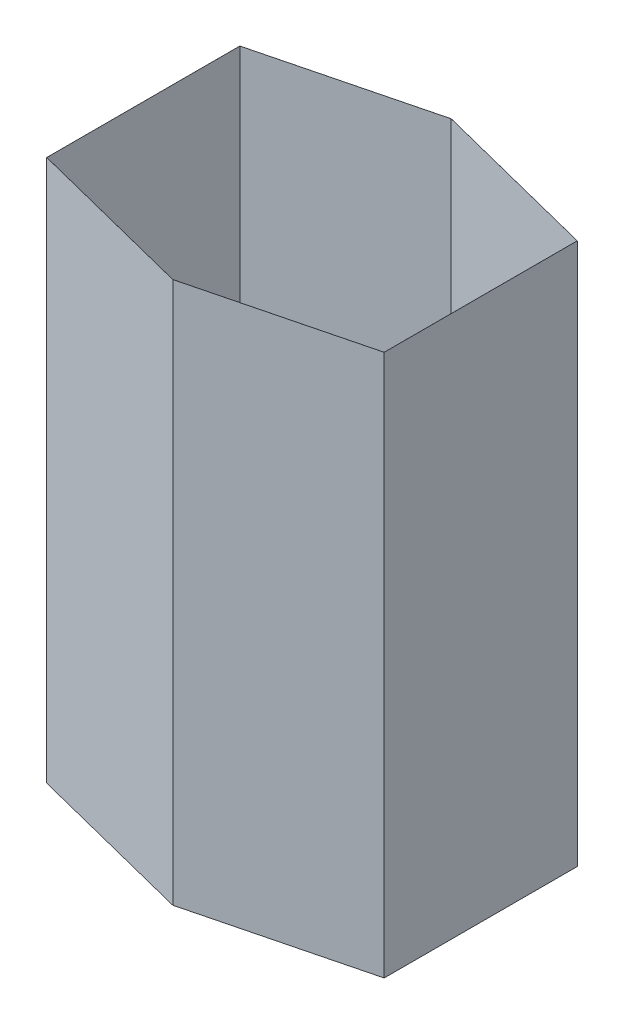
ISO-10303-21;
HEADER;
FILE_DESCRIPTION(('STEP AP214'),'2;1');
FILE_NAME('part.step','',(''),(''),'','','');
FILE_SCHEMA(('AUTOMOTIVE_DESIGN { 1 0 10303 214 1 1 1 1 }'));
ENDSEC;
DATA;
#1=APPLICATION_CONTEXT('core data for automotive mechanical design processes');
#2=APPLICATION_PROTOCOL_DEFINITION('international standard','automotive_design',2000,#1);
#3=PRODUCT_CONTEXT('',#1,'mechanical');
#4=PRODUCT('Part','Part','',(#3));
#5=PRODUCT_RELATED_PRODUCT_CATEGORY('part','',(#4));
#6=PRODUCT_DEFINITION_FORMATION('','',#4);
#7=PRODUCT_DEFINITION_CONTEXT('part definition',#1,'design');
#8=PRODUCT_DEFINITION('design','',#6,#7);
#9=PRODUCT_DEFINITION_SHAPE('','',#8);
#10=(LENGTH_UNIT() NAMED_UNIT(*) SI_UNIT(.MILLI.,.METRE.));
#11=(NAMED_UNIT(*) PLANE_ANGLE_UNIT() SI_UNIT($,.RADIAN.));
#12=(NAMED_UNIT(*) SI_UNIT($,.STERADIAN.) SOLID_ANGLE_UNIT());
#13=UNCERTAINTY_MEASURE_WITH_UNIT(LENGTH_MEASURE(1.E-05),#10,'distance_accuracy_value','');
#14=(GEOMETRIC_REPRESENTATION_CONTEXT(3) GLOBAL_UNCERTAINTY_ASSIGNED_CONTEXT((#13)) GLOBAL_UNIT_ASSIGNED_CONTEXT((#10,
#11,#12)) REPRESENTATION_CONTEXT('',''));
#15=CARTESIAN_POINT('',(0.,0.,0.));
#16=DIRECTION('',(0.,0.,1.));
#17=DIRECTION('',(1.,0.,0.));
#18=AXIS2_PLACEMENT_3D('',#15,#16,#17);
#19=CARTESIAN_POINT('',(0.,350.,0.));
#20=DIRECTION('',(0.,1.,0.));
#21=DIRECTION('',(0.,0.,1.));
#22=AXIS2_PLACEMENT_3D('',#19,#20,#21);
#23=PLANE('',#22);
#24=DIRECTION('',(-0.969445404241124,0.,-0.245307171105463));
#25=VECTOR('',#24,1.);
#26=CARTESIAN_POINT('',(22.541224999139,350.,-89.0821368283014));
#27=LINE('',#26,#25);
#28=CARTESIAN_POINT('',(128.154934328144,350.,-62.3577847893815));
#29=VERTEX_POINT('',#28);
#30=CARTESIAN_POINT('',(19.1792708914413,350.,-89.9328412082879));
#31=VERTEX_POINT('',#30);
#32=EDGE_CURVE('E209',#29,#31,#27,.T.);
#33=ORIENTED_EDGE('',*,*,#32,.T.);
#34=DIRECTION('',(-0.969445404241123,0.,0.245307171105463));
#35=VECTOR('',#34,1.);
#36=CARTESIAN_POINT('',(-20.2329764178513,350.,-79.9600187553107));
#37=LINE('',#36,#35);
#38=CARTESIAN_POINT('',(-89.7963925452609,350.,-62.3577847893816));
#39=VERTEX_POINT('',#38);
#40=EDGE_CURVE('E212',#31,#39,#37,.T.);
#41=ORIENTED_EDGE('',*,*,#40,.T.);
#42=DIRECTION('',(0.,0.,1.));
#43=VECTOR('',#42,1.);
#44=CARTESIAN_POINT('',(-89.7963925452609,350.,0.));
#45=LINE('',#44,#43);
#46=CARTESIAN_POINT('',(-89.7963925452609,350.,62.3577847893816));
#47=VERTEX_POINT('',#46);
#48=EDGE_CURVE('E215',#39,#47,#45,.T.);
#49=ORIENTED_EDGE('',*,*,#48,.T.);
#50=DIRECTION('',(0.969445404241123,0.,0.245307171105463));
#51=VECTOR('',#50,1.);
#52=CARTESIAN_POINT('',(-20.2329764178513,350.,79.9600187553107));
#53=LINE('',#52,#51);
#54=CARTESIAN_POINT('',(19.1792708914413,350.,89.9328412082879));
#55=VERTEX_POINT('',#54);
#56=EDGE_CURVE('E217',#47,#55,#53,.T.);
#57=ORIENTED_EDGE('',*,*,#56,.T.);
#58=DIRECTION('',(0.969445404241124,0.,-0.245307171105463));
#59=VECTOR('',#58,1.);
#60=CARTESIAN_POINT('',(22.541224999139,350.,89.0821368283014));
#61=LINE('',#60,#59);
#62=CARTESIAN_POINT('',(128.154934328144,350.,62.3577847893815));
#63=VERTEX_POINT('',#62);
#64=EDGE_CURVE('E219',#55,#63,#61,.T.);
#65=ORIENTED_EDGE('',*,*,#64,.T.);
#66=DIRECTION('',(0.,0.,-1.));
#67=VECTOR('',#66,1.);
#68=CARTESIAN_POINT('',(128.154934328144,350.,0.));
#69=LINE('',#68,#67);
#70=EDGE_CURVE('E221',#63,#29,#69,.T.);
#71=ORIENTED_EDGE('',*,*,#70,.T.);
#72=EDGE_LOOP('',(#33,#41,#49,#57,#65,#71));
#73=FACE_BOUND('',#72,.T.);
#74=DIRECTION('',(-0.969445404241123,0.,0.245307171105463));
#75=VECTOR('',#74,1.);
#76=CARTESIAN_POINT('',(-89.7863925452609,350.,-62.35));
#77=LINE('',#76,#75);
#78=CARTESIAN_POINT('',(19.1792708914413,350.,-89.922526032254));
#79=VERTEX_POINT('',#78);
#80=CARTESIAN_POINT('',(-89.7863925452609,350.,-62.35));
#81=VERTEX_POINT('',#80);
#82=EDGE_CURVE('E166',#79,#81,#77,.T.);
#83=ORIENTED_EDGE('',*,*,#82,.F.);
#84=DIRECTION('',(-0.969445404241124,0.,-0.245307171105463));
#85=VECTOR('',#84,1.);
#86=CARTESIAN_POINT('',(128.144934328144,350.,-62.35));
#87=LINE('',#86,#85);
#88=CARTESIAN_POINT('',(128.144934328144,350.,-62.35));
#89=VERTEX_POINT('',#88);
#90=EDGE_CURVE('E158',#89,#79,#87,.T.);
#91=ORIENTED_EDGE('',*,*,#90,.F.);
#92=DIRECTION('',(0.,0.,-1.));
#93=VECTOR('',#92,1.);
#94=CARTESIAN_POINT('',(128.144934328144,350.,62.35));
#95=LINE('',#94,#93);
#96=CARTESIAN_POINT('',(128.144934328144,350.,62.35));
#97=VERTEX_POINT('',#96);
#98=EDGE_CURVE('E187',#97,#89,#95,.T.);
#99=ORIENTED_EDGE('',*,*,#98,.F.);
#100=DIRECTION('',(0.969445404241124,0.,-0.245307171105463));
#101=VECTOR('',#100,1.);
#102=CARTESIAN_POINT('',(128.144934328144,350.,62.35));
#103=LINE('',#102,#101);
#104=CARTESIAN_POINT('',(19.1792708914413,350.,89.922526032254));
#105=VERTEX_POINT('',#104);
#106=EDGE_CURVE('E185',#105,#97,#103,.T.);
#107=ORIENTED_EDGE('',*,*,#106,.F.);
#108=DIRECTION('',(0.969445404241123,0.,0.245307171105463));
#109=VECTOR('',#108,1.);
#110=CARTESIAN_POINT('',(-89.7863925452609,350.,62.35));
#111=LINE('',#110,#109);
#112=CARTESIAN_POINT('',(-89.7863925452609,350.,62.35));
#113=VERTEX_POINT('',#112);
#114=EDGE_CURVE('E181',#113,#105,#111,.T.);
#115=ORIENTED_EDGE('',*,*,#114,.F.);
#116=DIRECTION('',(0.,0.,1.));
#117=VECTOR('',#116,1.);
#118=CARTESIAN_POINT('',(-89.7863925452609,350.,62.35));
#119=LINE('',#118,#117);
#120=EDGE_CURVE('E179',#81,#113,#119,.T.);
#121=ORIENTED_EDGE('',*,*,#120,.F.);
#122=EDGE_LOOP('',(#83,#91,#99,#107,#115,#121));
#123=FACE_BOUND('',#122,.T.);
#124=ADVANCED_FACE('F69',(#73,#123),#23,.T.);
#125=CARTESIAN_POINT('',(0.,0.,0.));
#126=DIRECTION('',(0.,1.,0.));
#127=DIRECTION('',(0.,0.,1.));
#128=AXIS2_PLACEMENT_3D('',#125,#126,#127);
#129=PLANE('',#128);
#130=DIRECTION('',(-0.969445404241124,0.,-0.245307171105463));
#131=VECTOR('',#130,1.);
#132=CARTESIAN_POINT('',(22.541224999139,0.,-89.0821368283014));
#133=LINE('',#132,#131);
#134=CARTESIAN_POINT('',(128.154934328144,0.,-62.3577847893815));
#135=VERTEX_POINT('',#134);
#136=CARTESIAN_POINT('',(19.1792708914413,0.,-89.9328412082879));
#137=VERTEX_POINT('',#136);
#138=EDGE_CURVE('E174',#135,#137,#133,.T.);
#139=ORIENTED_EDGE('',*,*,#138,.F.);
#140=DIRECTION('',(0.,0.,-1.));
#141=VECTOR('',#140,1.);
#142=CARTESIAN_POINT('',(128.154934328144,0.,0.));
#143=LINE('',#142,#141);
#144=CARTESIAN_POINT('',(128.154934328144,0.,62.3577847893815));
#145=VERTEX_POINT('',#144);
#146=EDGE_CURVE('E213',#145,#135,#143,.T.);
#147=ORIENTED_EDGE('',*,*,#146,.F.);
#148=DIRECTION('',(0.969445404241124,0.,-0.245307171105463));
#149=VECTOR('',#148,1.);
#150=CARTESIAN_POINT('',(22.541224999139,0.,89.0821368283014));
#151=LINE('',#150,#149);
#152=CARTESIAN_POINT('',(19.1792708914413,0.,89.9328412082879));
#153=VERTEX_POINT('',#152);
#154=EDGE_CURVE('E232',#153,#145,#151,.T.);
#155=ORIENTED_EDGE('',*,*,#154,.F.);
#156=DIRECTION('',(0.969445404241123,0.,0.245307171105463));
#157=VECTOR('',#156,1.);
#158=CARTESIAN_POINT('',(-20.2329764178513,0.,79.9600187553107));
#159=LINE('',#158,#157);
#160=CARTESIAN_POINT('',(-89.7963925452609,0.,62.3577847893816));
#161=VERTEX_POINT('',#160);
#162=EDGE_CURVE('E230',#161,#153,#159,.T.);
#163=ORIENTED_EDGE('',*,*,#162,.F.);
#164=DIRECTION('',(0.,0.,1.));
#165=VECTOR('',#164,1.);
#166=CARTESIAN_POINT('',(-89.7963925452609,0.,0.));
#167=LINE('',#166,#165);
#168=CARTESIAN_POINT('',(-89.7963925452609,0.,-62.3577847893816));
#169=VERTEX_POINT('',#168);
#170=EDGE_CURVE('E228',#169,#161,#167,.T.);
#171=ORIENTED_EDGE('',*,*,#170,.F.);
#172=DIRECTION('',(-0.969445404241123,0.,0.245307171105463));
#173=VECTOR('',#172,1.);
#174=CARTESIAN_POINT('',(-20.2329764178513,0.,-79.9600187553107));
#175=LINE('',#174,#173);
#176=EDGE_CURVE('E226',#137,#169,#175,.T.);
#177=ORIENTED_EDGE('',*,*,#176,.F.);
#178=EDGE_LOOP('',(#139,#147,#155,#163,#171,#177));
#179=FACE_BOUND('',#178,.T.);
#180=DIRECTION('',(-0.969445404241124,0.,-0.245307171105463));
#181=VECTOR('',#180,1.);
#182=CARTESIAN_POINT('',(128.144934328144,0.,-62.35));
#183=LINE('',#182,#181);
#184=CARTESIAN_POINT('',(128.144934328144,0.,-62.35));
#185=VERTEX_POINT('',#184);
#186=CARTESIAN_POINT('',(19.1792708914413,0.,-89.922526032254));
#187=VERTEX_POINT('',#186);
#188=EDGE_CURVE('E92',#185,#187,#183,.T.);
#189=ORIENTED_EDGE('',*,*,#188,.T.);
#190=DIRECTION('',(-0.969445404241123,0.,0.245307171105463));
#191=VECTOR('',#190,1.);
#192=CARTESIAN_POINT('',(-89.7863925452609,0.,-62.35));
#193=LINE('',#192,#191);
#194=CARTESIAN_POINT('',(-89.7863925452609,0.,-62.35));
#195=VERTEX_POINT('',#194);
#196=EDGE_CURVE('E173',#187,#195,#193,.T.);
#197=ORIENTED_EDGE('',*,*,#196,.T.);
#198=DIRECTION('',(0.,0.,1.));
#199=VECTOR('',#198,1.);
#200=CARTESIAN_POINT('',(-89.7863925452609,0.,62.35));
#201=LINE('',#200,#199);
#202=CARTESIAN_POINT('',(-89.7863925452609,0.,62.35));
#203=VERTEX_POINT('',#202);
#204=EDGE_CURVE('E191',#195,#203,#201,.T.);
#205=ORIENTED_EDGE('',*,*,#204,.T.);
#206=DIRECTION('',(0.969445404241123,0.,0.245307171105463));
#207=VECTOR('',#206,1.);
#208=CARTESIAN_POINT('',(-89.7863925452609,0.,62.35));
#209=LINE('',#208,#207);
#210=CARTESIAN_POINT('',(19.1792708914413,0.,89.922526032254));
#211=VERTEX_POINT('',#210);
#212=EDGE_CURVE('E194',#203,#211,#209,.T.);
#213=ORIENTED_EDGE('',*,*,#212,.T.);
#214=DIRECTION('',(0.969445404241124,0.,-0.245307171105463));
#215=VECTOR('',#214,1.);
#216=CARTESIAN_POINT('',(128.144934328144,0.,62.35));
#217=LINE('',#216,#215);
#218=CARTESIAN_POINT('',(128.144934328144,0.,62.35));
#219=VERTEX_POINT('',#218);
#220=EDGE_CURVE('E197',#211,#219,#217,.T.);
#221=ORIENTED_EDGE('',*,*,#220,.T.);
#222=DIRECTION('',(0.,0.,-1.));
#223=VECTOR('',#222,1.);
#224=CARTESIAN_POINT('',(128.144934328144,0.,62.35));
#225=LINE('',#224,#223);
#226=EDGE_CURVE('E167',#219,#185,#225,.T.);
#227=ORIENTED_EDGE('',*,*,#226,.T.);
#228=EDGE_LOOP('',(#189,#197,#205,#213,#221,#227));
#229=FACE_BOUND('',#228,.T.);
#230=ADVANCED_FACE('F256',(#179,#229),#129,.F.);
#231=CARTESIAN_POINT('',(22.541224999139,350.,-89.0821368283014));
#232=DIRECTION('',(-0.245307171105463,0.,0.969445404241123));
#233=DIRECTION('',(0.969445404241123,0.,0.245307171105463));
#234=AXIS2_PLACEMENT_3D('',#231,#232,#233);
#235=PLANE('',#234);
#236=ORIENTED_EDGE('',*,*,#138,.T.);
#237=DIRECTION('',(0.,-1.,0.));
#238=VECTOR('',#237,1.);
#239=CARTESIAN_POINT('',(19.1792708914413,350.,-89.9328412082879));
#240=LINE('',#239,#238);
#241=EDGE_CURVE('E12',#31,#137,#240,.T.);
#242=ORIENTED_EDGE('',*,*,#241,.F.);
#243=ORIENTED_EDGE('',*,*,#32,.F.);
#244=DIRECTION('',(0.,-1.,0.));
#245=VECTOR('',#244,1.);
#246=CARTESIAN_POINT('',(128.154934328144,350.,-62.3577847893815));
#247=LINE('',#246,#245);
#248=EDGE_CURVE('E223',#29,#135,#247,.T.);
#249=ORIENTED_EDGE('',*,*,#248,.T.);
#250=EDGE_LOOP('',(#236,#242,#243,#249));
#251=FACE_BOUND('',#250,.T.);
#252=ADVANCED_FACE('F71',(#251),#235,.F.);
#253=CARTESIAN_POINT('',(-20.2329764178513,350.,-79.9600187553107));
#254=DIRECTION('',(0.245307171105463,0.,0.969445404241123));
#255=DIRECTION('',(0.969445404241124,0.,-0.245307171105463));
#256=AXIS2_PLACEMENT_3D('',#253,#254,#255);
#257=PLANE('',#256);
#258=ORIENTED_EDGE('',*,*,#176,.T.);
#259=DIRECTION('',(0.,-1.,0.));
#260=VECTOR('',#259,1.);
#261=CARTESIAN_POINT('',(-89.7963925452609,350.,-62.3577847893816));
#262=LINE('',#261,#260);
#263=EDGE_CURVE('E77',#39,#169,#262,.T.);
#264=ORIENTED_EDGE('',*,*,#263,.F.);
#265=ORIENTED_EDGE('',*,*,#40,.F.);
#266=ORIENTED_EDGE('',*,*,#241,.T.);
#267=EDGE_LOOP('',(#258,#264,#265,#266));
#268=FACE_BOUND('',#267,.T.);
#269=ADVANCED_FACE('F273',(#268),#257,.F.);
#270=CARTESIAN_POINT('',(-89.7963925452609,350.,0.));
#271=DIRECTION('',(1.,0.,0.));
#272=DIRECTION('',(0.,0.,-1.));
#273=AXIS2_PLACEMENT_3D('',#270,#271,#272);
#274=PLANE('',#273);
#275=ORIENTED_EDGE('',*,*,#170,.T.);
#276=DIRECTION('',(0.,-1.,0.));
#277=VECTOR('',#276,1.);
#278=CARTESIAN_POINT('',(-89.7963925452609,350.,62.3577847893816));
#279=LINE('',#278,#277);
#280=EDGE_CURVE('E243',#47,#161,#279,.T.);
#281=ORIENTED_EDGE('',*,*,#280,.F.);
#282=ORIENTED_EDGE('',*,*,#48,.F.);
#283=ORIENTED_EDGE('',*,*,#263,.T.);
#284=EDGE_LOOP('',(#275,#281,#282,#283));
#285=FACE_BOUND('',#284,.T.);
#286=ADVANCED_FACE('F250',(#285),#274,.F.);
#287=CARTESIAN_POINT('',(-20.2329764178513,350.,79.9600187553107));
#288=DIRECTION('',(0.245307171105463,0.,-0.969445404241123));
#289=DIRECTION('',(-0.969445404241124,0.,-0.245307171105463));
#290=AXIS2_PLACEMENT_3D('',#287,#288,#289);
#291=PLANE('',#290);
#292=ORIENTED_EDGE('',*,*,#162,.T.);
#293=DIRECTION('',(0.,-1.,0.));
#294=VECTOR('',#293,1.);
#295=CARTESIAN_POINT('',(19.1792708914413,350.,89.9328412082879));
#296=LINE('',#295,#294);
#297=EDGE_CURVE('E240',#55,#153,#296,.T.);
#298=ORIENTED_EDGE('',*,*,#297,.F.);
#299=ORIENTED_EDGE('',*,*,#56,.F.);
#300=ORIENTED_EDGE('',*,*,#280,.T.);
#301=EDGE_LOOP('',(#292,#298,#299,#300));
#302=FACE_BOUND('',#301,.T.);
#303=ADVANCED_FACE('F262',(#302),#291,.F.);
#304=CARTESIAN_POINT('',(22.541224999139,350.,89.0821368283014));
#305=DIRECTION('',(-0.245307171105463,0.,-0.969445404241123));
#306=DIRECTION('',(-0.969445404241123,0.,0.245307171105463));
#307=AXIS2_PLACEMENT_3D('',#304,#305,#306);
#308=PLANE('',#307);
#309=ORIENTED_EDGE('',*,*,#154,.T.);
#310=DIRECTION('',(0.,-1.,0.));
#311=VECTOR('',#310,1.);
#312=CARTESIAN_POINT('',(128.154934328144,350.,62.3577847893815));
#313=LINE('',#312,#311);
#314=EDGE_CURVE('E237',#63,#145,#313,.T.);
#315=ORIENTED_EDGE('',*,*,#314,.F.);
#316=ORIENTED_EDGE('',*,*,#64,.F.);
#317=ORIENTED_EDGE('',*,*,#297,.T.);
#318=EDGE_LOOP('',(#309,#315,#316,#317));
#319=FACE_BOUND('',#318,.T.);
#320=ADVANCED_FACE('F266',(#319),#308,.F.);
#321=CARTESIAN_POINT('',(128.154934328144,350.,0.));
#322=DIRECTION('',(-1.,0.,0.));
#323=DIRECTION('',(0.,0.,1.));
#324=AXIS2_PLACEMENT_3D('',#321,#322,#323);
#325=PLANE('',#324);
#326=ORIENTED_EDGE('',*,*,#146,.T.);
#327=ORIENTED_EDGE('',*,*,#248,.F.);
#328=ORIENTED_EDGE('',*,*,#70,.F.);
#329=ORIENTED_EDGE('',*,*,#314,.T.);
#330=EDGE_LOOP('',(#326,#327,#328,#329));
#331=FACE_BOUND('',#330,.T.);
#332=ADVANCED_FACE('F276',(#331),#325,.F.);
#333=CARTESIAN_POINT('',(128.144934328144,350.,-62.35));
#334=DIRECTION('',(-0.245307171105463,0.,0.969445404241123));
#335=DIRECTION('',(0.969445404241123,0.,0.245307171105463));
#336=AXIS2_PLACEMENT_3D('',#333,#334,#335);
#337=PLANE('',#336);
#338=ORIENTED_EDGE('',*,*,#188,.F.);
#339=DIRECTION('',(0.,-1.,0.));
#340=VECTOR('',#339,1.);
#341=CARTESIAN_POINT('',(128.144934328144,350.,-62.35));
#342=LINE('',#341,#340);
#343=EDGE_CURVE('E162',#89,#185,#342,.T.);
#344=ORIENTED_EDGE('',*,*,#343,.F.);
#345=ORIENTED_EDGE('',*,*,#90,.T.);
#346=DIRECTION('',(0.,-1.,0.));
#347=VECTOR('',#346,1.);
#348=CARTESIAN_POINT('',(19.1792708914413,350.,-89.922526032254));
#349=LINE('',#348,#347);
#350=EDGE_CURVE('E161',#79,#187,#349,.T.);
#351=ORIENTED_EDGE('',*,*,#350,.T.);
#352=EDGE_LOOP('',(#338,#344,#345,#351));
#353=FACE_BOUND('',#352,.T.);
#354=ADVANCED_FACE('F160',(#353),#337,.T.);
#355=CARTESIAN_POINT('',(-89.7863925452609,350.,-62.35));
#356=DIRECTION('',(0.245307171105463,0.,0.969445404241123));
#357=DIRECTION('',(0.969445404241124,0.,-0.245307171105463));
#358=AXIS2_PLACEMENT_3D('',#355,#356,#357);
#359=PLANE('',#358);
#360=ORIENTED_EDGE('',*,*,#196,.F.);
#361=ORIENTED_EDGE('',*,*,#350,.F.);
#362=ORIENTED_EDGE('',*,*,#82,.T.);
#363=DIRECTION('',(0.,-1.,0.));
#364=VECTOR('',#363,1.);
#365=CARTESIAN_POINT('',(-89.7863925452609,350.,-62.35));
#366=LINE('',#365,#364);
#367=EDGE_CURVE('E175',#81,#195,#366,.T.);
#368=ORIENTED_EDGE('',*,*,#367,.T.);
#369=EDGE_LOOP('',(#360,#361,#362,#368));
#370=FACE_BOUND('',#369,.T.);
#371=ADVANCED_FACE('F170',(#370),#359,.T.);
#372=CARTESIAN_POINT('',(-89.7863925452609,350.,62.35));
#373=DIRECTION('',(1.,0.,0.));
#374=DIRECTION('',(0.,0.,-1.));
#375=AXIS2_PLACEMENT_3D('',#372,#373,#374);
#376=PLANE('',#375);
#377=ORIENTED_EDGE('',*,*,#204,.F.);
#378=ORIENTED_EDGE('',*,*,#367,.F.);
#379=ORIENTED_EDGE('',*,*,#120,.T.);
#380=DIRECTION('',(0.,-1.,0.));
#381=VECTOR('',#380,1.);
#382=CARTESIAN_POINT('',(-89.7863925452609,350.,62.35));
#383=LINE('',#382,#381);
#384=EDGE_CURVE('E206',#113,#203,#383,.T.);
#385=ORIENTED_EDGE('',*,*,#384,.T.);
#386=EDGE_LOOP('',(#377,#378,#379,#385));
#387=FACE_BOUND('',#386,.T.);
#388=ADVANCED_FACE('F294',(#387),#376,.T.);
#389=CARTESIAN_POINT('',(-89.7863925452609,350.,62.35));
#390=DIRECTION('',(0.245307171105463,0.,-0.969445404241123));
#391=DIRECTION('',(-0.969445404241124,0.,-0.245307171105463));
#392=AXIS2_PLACEMENT_3D('',#389,#390,#391);
#393=PLANE('',#392);
#394=ORIENTED_EDGE('',*,*,#212,.F.);
#395=ORIENTED_EDGE('',*,*,#384,.F.);
#396=ORIENTED_EDGE('',*,*,#114,.T.);
#397=DIRECTION('',(0.,-1.,0.));
#398=VECTOR('',#397,1.);
#399=CARTESIAN_POINT('',(19.1792708914413,350.,89.922526032254));
#400=LINE('',#399,#398);
#401=EDGE_CURVE('E204',#105,#211,#400,.T.);
#402=ORIENTED_EDGE('',*,*,#401,.T.);
#403=EDGE_LOOP('',(#394,#395,#396,#402));
#404=FACE_BOUND('',#403,.T.);
#405=ADVANCED_FACE('F297',(#404),#393,.T.);
#406=CARTESIAN_POINT('',(128.144934328144,350.,62.35));
#407=DIRECTION('',(-0.245307171105463,0.,-0.969445404241123));
#408=DIRECTION('',(-0.969445404241123,0.,0.245307171105463));
#409=AXIS2_PLACEMENT_3D('',#406,#407,#408);
#410=PLANE('',#409);
#411=ORIENTED_EDGE('',*,*,#220,.F.);
#412=ORIENTED_EDGE('',*,*,#401,.F.);
#413=ORIENTED_EDGE('',*,*,#106,.T.);
#414=DIRECTION('',(0.,-1.,0.));
#415=VECTOR('',#414,1.);
#416=CARTESIAN_POINT('',(128.144934328144,350.,62.35));
#417=LINE('',#416,#415);
#418=EDGE_CURVE('E84',#97,#219,#417,.T.);
#419=ORIENTED_EDGE('',*,*,#418,.T.);
#420=EDGE_LOOP('',(#411,#412,#413,#419));
#421=FACE_BOUND('',#420,.T.);
#422=ADVANCED_FACE('F301',(#421),#410,.T.);
#423=CARTESIAN_POINT('',(128.144934328144,350.,62.35));
#424=DIRECTION('',(-1.,0.,0.));
#425=DIRECTION('',(0.,0.,1.));
#426=AXIS2_PLACEMENT_3D('',#423,#424,#425);
#427=PLANE('',#426);
#428=ORIENTED_EDGE('',*,*,#226,.F.);
#429=ORIENTED_EDGE('',*,*,#418,.F.);
#430=ORIENTED_EDGE('',*,*,#98,.T.);
#431=ORIENTED_EDGE('',*,*,#343,.T.);
#432=EDGE_LOOP('',(#428,#429,#430,#431));
#433=FACE_BOUND('',#432,.T.);
#434=ADVANCED_FACE('F305',(#433),#427,.T.);
#435=CLOSED_SHELL('',(#124,#230,#252,#269,#286,#303,#320,#332,#354,#371,#388,#405,#422,#434));
#436=MANIFOLD_SOLID_BREP('B2',#435);
#437=ADVANCED_BREP_SHAPE_REPRESENTATION('',(#18,#436),#14);
#438=SHAPE_DEFINITION_REPRESENTATION(#9,#437);
ENDSEC;
END-ISO-10303-21;
